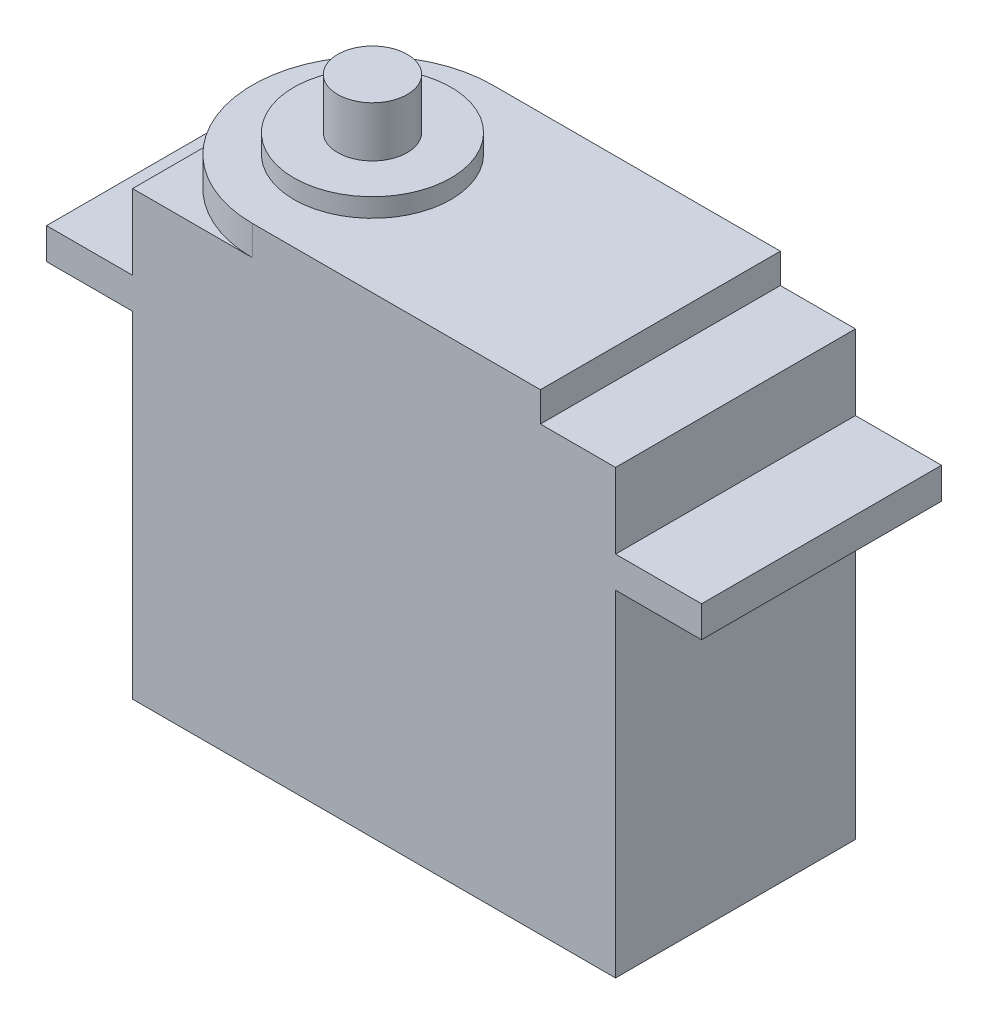
ISO-10303-21;
HEADER;
FILE_DESCRIPTION(('STEP AP214'),'2;1');
FILE_NAME('part.step','',(''),(''),'','','');
FILE_SCHEMA(('AUTOMOTIVE_DESIGN { 1 0 10303 214 1 1 1 1 }'));
ENDSEC;
DATA;
#1=APPLICATION_CONTEXT('core data for automotive mechanical design processes');
#2=APPLICATION_PROTOCOL_DEFINITION('international standard','automotive_design',2000,#1);
#3=PRODUCT_CONTEXT('',#1,'mechanical');
#4=PRODUCT('Part','Part','',(#3));
#5=PRODUCT_RELATED_PRODUCT_CATEGORY('part','',(#4));
#6=PRODUCT_DEFINITION_FORMATION('','',#4);
#7=PRODUCT_DEFINITION_CONTEXT('part definition',#1,'design');
#8=PRODUCT_DEFINITION('design','',#6,#7);
#9=PRODUCT_DEFINITION_SHAPE('','',#8);
#10=(LENGTH_UNIT() NAMED_UNIT(*) SI_UNIT(.MILLI.,.METRE.));
#11=(NAMED_UNIT(*) PLANE_ANGLE_UNIT() SI_UNIT($,.RADIAN.));
#12=(NAMED_UNIT(*) SI_UNIT($,.STERADIAN.) SOLID_ANGLE_UNIT());
#13=UNCERTAINTY_MEASURE_WITH_UNIT(LENGTH_MEASURE(1.E-05),#10,'distance_accuracy_value','');
#14=(GEOMETRIC_REPRESENTATION_CONTEXT(3) GLOBAL_UNCERTAINTY_ASSIGNED_CONTEXT((#13)) GLOBAL_UNIT_ASSIGNED_CONTEXT((#10,
#11,#12)) REPRESENTATION_CONTEXT('',''));
#15=CARTESIAN_POINT('',(0.,0.,0.));
#16=DIRECTION('',(0.,0.,1.));
#17=DIRECTION('',(1.,0.,0.));
#18=AXIS2_PLACEMENT_3D('',#15,#16,#17);
#19=CARTESIAN_POINT('',(-10.13,40.9,0.));
#20=DIRECTION('',(0.,1.,0.));
#21=DIRECTION('',(0.,0.,1.));
#22=AXIS2_PLACEMENT_3D('',#19,#20,#21);
#23=PLANE('',#22);
#24=CARTESIAN_POINT('',(-10.13,40.9,0.));
#25=DIRECTION('',(0.,1.,0.));
#26=DIRECTION('',(0.,0.,1.));
#27=AXIS2_PLACEMENT_3D('',#24,#25,#26);
#28=CIRCLE('',#27,6.55);
#29=CARTESIAN_POINT('',(-10.13,40.9,6.55));
#30=VERTEX_POINT('',#29);
#31=EDGE_CURVE('E186',#30,#30,#28,.T.);
#32=ORIENTED_EDGE('',*,*,#31,.T.);
#33=EDGE_LOOP('',(#32));
#34=FACE_BOUND('',#33,.T.);
#35=CARTESIAN_POINT('',(-10.13,40.9,0.));
#36=DIRECTION('',(0.,1.,0.));
#37=DIRECTION('',(0.,0.,1.));
#38=AXIS2_PLACEMENT_3D('',#35,#36,#37);
#39=CIRCLE('',#38,2.9);
#40=CARTESIAN_POINT('',(-10.13,40.9,2.9));
#41=VERTEX_POINT('',#40);
#42=EDGE_CURVE('E215',#41,#41,#39,.T.);
#43=ORIENTED_EDGE('',*,*,#42,.F.);
#44=EDGE_LOOP('',(#43));
#45=FACE_BOUND('',#44,.T.);
#46=ADVANCED_FACE('F34',(#34,#45),#23,.T.);
#47=CARTESIAN_POINT('',(0.,39.34,0.));
#48=DIRECTION('',(0.,1.,0.));
#49=DIRECTION('',(0.,0.,1.));
#50=AXIS2_PLACEMENT_3D('',#47,#48,#49);
#51=PLANE('',#50);
#52=CARTESIAN_POINT('',(-10.13,39.34,0.));
#53=DIRECTION('',(0.,1.,0.));
#54=DIRECTION('',(0.,0.,1.));
#55=AXIS2_PLACEMENT_3D('',#52,#53,#54);
#56=CIRCLE('',#55,10.);
#57=CARTESIAN_POINT('',(-10.13,39.34,-10.));
#58=VERTEX_POINT('',#57);
#59=CARTESIAN_POINT('',(-10.13,39.34,10.));
#60=VERTEX_POINT('',#59);
#61=EDGE_CURVE('E164',#58,#60,#56,.T.);
#62=ORIENTED_EDGE('',*,*,#61,.T.);
#63=DIRECTION('',(1.,0.,0.));
#64=VECTOR('',#63,1.);
#65=CARTESIAN_POINT('',(0.,39.34,10.));
#66=LINE('',#65,#64);
#67=CARTESIAN_POINT('',(13.87,39.34,10.));
#68=VERTEX_POINT('',#67);
#69=EDGE_CURVE('E152',#60,#68,#66,.T.);
#70=ORIENTED_EDGE('',*,*,#69,.T.);
#71=DIRECTION('',(0.,0.,1.));
#72=VECTOR('',#71,1.);
#73=CARTESIAN_POINT('',(13.87,39.34,0.));
#74=LINE('',#73,#72);
#75=CARTESIAN_POINT('',(13.87,39.34,-10.));
#76=VERTEX_POINT('',#75);
#77=EDGE_CURVE('E163',#76,#68,#74,.T.);
#78=ORIENTED_EDGE('',*,*,#77,.F.);
#79=DIRECTION('',(-1.,0.,0.));
#80=VECTOR('',#79,1.);
#81=CARTESIAN_POINT('',(0.,39.34,-10.));
#82=LINE('',#81,#80);
#83=EDGE_CURVE('E170',#76,#58,#82,.T.);
#84=ORIENTED_EDGE('',*,*,#83,.T.);
#85=EDGE_LOOP('',(#62,#70,#78,#84));
#86=FACE_BOUND('',#85,.T.);
#87=CARTESIAN_POINT('',(-10.13,39.34,0.));
#88=DIRECTION('',(0.,1.,0.));
#89=DIRECTION('',(0.,0.,1.));
#90=AXIS2_PLACEMENT_3D('',#87,#88,#89);
#91=CIRCLE('',#90,6.55);
#92=CARTESIAN_POINT('',(-10.13,39.34,6.55));
#93=VERTEX_POINT('',#92);
#94=EDGE_CURVE('E209',#93,#93,#91,.T.);
#95=ORIENTED_EDGE('',*,*,#94,.F.);
#96=EDGE_LOOP('',(#95));
#97=FACE_BOUND('',#96,.T.);
#98=ADVANCED_FACE('F167',(#86,#97),#51,.T.);
#99=CARTESIAN_POINT('',(0.,36.86,0.));
#100=DIRECTION('',(0.,-1.,0.));
#101=DIRECTION('',(0.,0.,-1.));
#102=AXIS2_PLACEMENT_3D('',#99,#100,#101);
#103=PLANE('',#102);
#104=CARTESIAN_POINT('',(-10.13,36.86,0.));
#105=DIRECTION('',(0.,1.,0.));
#106=DIRECTION('',(0.,0.,1.));
#107=AXIS2_PLACEMENT_3D('',#104,#105,#106);
#108=CIRCLE('',#107,10.);
#109=CARTESIAN_POINT('',(-10.13,36.86,-10.));
#110=VERTEX_POINT('',#109);
#111=CARTESIAN_POINT('',(-20.13,36.86,0.));
#112=VERTEX_POINT('',#111);
#113=EDGE_CURVE('E183',#110,#112,#108,.T.);
#114=ORIENTED_EDGE('',*,*,#113,.F.);
#115=DIRECTION('',(-1.,0.,0.));
#116=VECTOR('',#115,1.);
#117=CARTESIAN_POINT('',(-20.13,36.86,-10.));
#118=LINE('',#117,#116);
#119=CARTESIAN_POINT('',(-20.13,36.86,-10.));
#120=VERTEX_POINT('',#119);
#121=EDGE_CURVE('E368',#110,#120,#118,.T.);
#122=ORIENTED_EDGE('',*,*,#121,.T.);
#123=DIRECTION('',(0.,0.,1.));
#124=VECTOR('',#123,1.);
#125=CARTESIAN_POINT('',(-20.13,36.86,10.));
#126=LINE('',#125,#124);
#127=EDGE_CURVE('E371',#120,#112,#126,.T.);
#128=ORIENTED_EDGE('',*,*,#127,.T.);
#129=EDGE_LOOP('',(#114,#122,#128));
#130=FACE_BOUND('',#129,.T.);
#131=ADVANCED_FACE('F236',(#130),#103,.F.);
#132=CARTESIAN_POINT('',(-10.13,36.86,10.));
#133=VERTEX_POINT('',#132);
#134=EDGE_CURVE('E11',#112,#133,#108,.T.);
#135=ORIENTED_EDGE('',*,*,#134,.F.);
#136=CARTESIAN_POINT('',(-20.13,36.86,10.));
#137=VERTEX_POINT('',#136);
#138=EDGE_CURVE('E378',#112,#137,#126,.T.);
#139=ORIENTED_EDGE('',*,*,#138,.T.);
#140=DIRECTION('',(1.,0.,0.));
#141=VECTOR('',#140,1.);
#142=CARTESIAN_POINT('',(-20.13,36.86,10.));
#143=LINE('',#142,#141);
#144=EDGE_CURVE('E440',#137,#133,#143,.T.);
#145=ORIENTED_EDGE('',*,*,#144,.T.);
#146=EDGE_LOOP('',(#135,#139,#145));
#147=FACE_BOUND('',#146,.T.);
#148=ADVANCED_FACE('F277',(#147),#103,.F.);
#149=CARTESIAN_POINT('',(-20.13,36.86,10.));
#150=DIRECTION('',(1.,0.,0.));
#151=DIRECTION('',(0.,0.,-1.));
#152=AXIS2_PLACEMENT_3D('',#149,#150,#151);
#153=PLANE('',#152);
#154=DIRECTION('',(0.,0.,1.));
#155=VECTOR('',#154,1.);
#156=CARTESIAN_POINT('',(-20.13,28.,-10.));
#157=LINE('',#156,#155);
#158=CARTESIAN_POINT('',(-20.13,28.,-10.));
#159=VERTEX_POINT('',#158);
#160=CARTESIAN_POINT('',(-20.13,28.,10.));
#161=VERTEX_POINT('',#160);
#162=EDGE_CURVE('E59',#159,#161,#157,.T.);
#163=ORIENTED_EDGE('',*,*,#162,.F.);
#164=DIRECTION('',(0.,-1.,0.));
#165=VECTOR('',#164,1.);
#166=CARTESIAN_POINT('',(-20.13,36.86,-10.));
#167=LINE('',#166,#165);
#168=CARTESIAN_POINT('',(-20.13,0.,-10.));
#169=VERTEX_POINT('',#168);
#170=EDGE_CURVE('E299',#159,#169,#167,.T.);
#171=ORIENTED_EDGE('',*,*,#170,.T.);
#172=DIRECTION('',(0.,0.,1.));
#173=VECTOR('',#172,1.);
#174=CARTESIAN_POINT('',(-20.13,0.,10.));
#175=LINE('',#174,#173);
#176=CARTESIAN_POINT('',(-20.13,0.,10.));
#177=VERTEX_POINT('',#176);
#178=EDGE_CURVE('E305',#169,#177,#175,.T.);
#179=ORIENTED_EDGE('',*,*,#178,.T.);
#180=DIRECTION('',(0.,-1.,0.));
#181=VECTOR('',#180,1.);
#182=CARTESIAN_POINT('',(-20.13,36.86,10.));
#183=LINE('',#182,#181);
#184=EDGE_CURVE('E327',#161,#177,#183,.T.);
#185=ORIENTED_EDGE('',*,*,#184,.F.);
#186=EDGE_LOOP('',(#163,#171,#179,#185));
#187=FACE_BOUND('',#186,.T.);
#188=ADVANCED_FACE('F284',(#187),#153,.F.);
#189=DIRECTION('',(0.,0.,-1.));
#190=VECTOR('',#189,1.);
#191=CARTESIAN_POINT('',(-20.13,30.6,-10.));
#192=LINE('',#191,#190);
#193=CARTESIAN_POINT('',(-20.13,30.6,10.));
#194=VERTEX_POINT('',#193);
#195=CARTESIAN_POINT('',(-20.13,30.6,-10.));
#196=VERTEX_POINT('',#195);
#197=EDGE_CURVE('E177',#194,#196,#192,.T.);
#198=ORIENTED_EDGE('',*,*,#197,.F.);
#199=EDGE_CURVE('E339',#137,#194,#183,.T.);
#200=ORIENTED_EDGE('',*,*,#199,.F.);
#201=ORIENTED_EDGE('',*,*,#138,.F.);
#202=ORIENTED_EDGE('',*,*,#127,.F.);
#203=EDGE_CURVE('E330',#120,#196,#167,.T.);
#204=ORIENTED_EDGE('',*,*,#203,.T.);
#205=EDGE_LOOP('',(#198,#200,#201,#202,#204));
#206=FACE_BOUND('',#205,.T.);
#207=ADVANCED_FACE('F286',(#206),#153,.F.);
#208=CARTESIAN_POINT('',(20.13,36.86,10.));
#209=DIRECTION('',(-1.,0.,0.));
#210=DIRECTION('',(0.,0.,1.));
#211=AXIS2_PLACEMENT_3D('',#208,#209,#210);
#212=PLANE('',#211);
#213=DIRECTION('',(0.,0.,-1.));
#214=VECTOR('',#213,1.);
#215=CARTESIAN_POINT('',(20.13,28.,10.));
#216=LINE('',#215,#214);
#217=CARTESIAN_POINT('',(20.13,28.,10.));
#218=VERTEX_POINT('',#217);
#219=CARTESIAN_POINT('',(20.13,28.,-10.));
#220=VERTEX_POINT('',#219);
#221=EDGE_CURVE('E353',#218,#220,#216,.T.);
#222=ORIENTED_EDGE('',*,*,#221,.F.);
#223=DIRECTION('',(0.,-1.,0.));
#224=VECTOR('',#223,1.);
#225=CARTESIAN_POINT('',(20.13,36.86,10.));
#226=LINE('',#225,#224);
#227=CARTESIAN_POINT('',(20.13,0.,10.));
#228=VERTEX_POINT('',#227);
#229=EDGE_CURVE('E322',#218,#228,#226,.T.);
#230=ORIENTED_EDGE('',*,*,#229,.T.);
#231=DIRECTION('',(0.,0.,-1.));
#232=VECTOR('',#231,1.);
#233=CARTESIAN_POINT('',(20.13,0.,10.));
#234=LINE('',#233,#232);
#235=CARTESIAN_POINT('',(20.13,0.,-10.));
#236=VERTEX_POINT('',#235);
#237=EDGE_CURVE('E306',#228,#236,#234,.T.);
#238=ORIENTED_EDGE('',*,*,#237,.T.);
#239=DIRECTION('',(0.,-1.,0.));
#240=VECTOR('',#239,1.);
#241=CARTESIAN_POINT('',(20.13,36.86,-10.));
#242=LINE('',#241,#240);
#243=EDGE_CURVE('E302',#220,#236,#242,.T.);
#244=ORIENTED_EDGE('',*,*,#243,.F.);
#245=EDGE_LOOP('',(#222,#230,#238,#244));
#246=FACE_BOUND('',#245,.T.);
#247=ADVANCED_FACE('F36',(#246),#212,.F.);
#248=DIRECTION('',(0.,0.,1.));
#249=VECTOR('',#248,1.);
#250=CARTESIAN_POINT('',(20.13,30.6,10.));
#251=LINE('',#250,#249);
#252=CARTESIAN_POINT('',(20.13,30.6,-10.));
#253=VERTEX_POINT('',#252);
#254=CARTESIAN_POINT('',(20.13,30.6,10.));
#255=VERTEX_POINT('',#254);
#256=EDGE_CURVE('E358',#253,#255,#251,.T.);
#257=ORIENTED_EDGE('',*,*,#256,.F.);
#258=CARTESIAN_POINT('',(20.13,36.86,-10.));
#259=VERTEX_POINT('',#258);
#260=EDGE_CURVE('E43',#259,#253,#242,.T.);
#261=ORIENTED_EDGE('',*,*,#260,.F.);
#262=DIRECTION('',(0.,0.,-1.));
#263=VECTOR('',#262,1.);
#264=CARTESIAN_POINT('',(20.13,36.86,10.));
#265=LINE('',#264,#263);
#266=CARTESIAN_POINT('',(20.13,36.86,10.));
#267=VERTEX_POINT('',#266);
#268=EDGE_CURVE('E312',#267,#259,#265,.T.);
#269=ORIENTED_EDGE('',*,*,#268,.F.);
#270=EDGE_CURVE('E325',#267,#255,#226,.T.);
#271=ORIENTED_EDGE('',*,*,#270,.T.);
#272=EDGE_LOOP('',(#257,#261,#269,#271));
#273=FACE_BOUND('',#272,.T.);
#274=ADVANCED_FACE('F288',(#273),#212,.F.);
#275=CARTESIAN_POINT('',(-20.13,36.86,-10.));
#276=DIRECTION('',(0.,0.,1.));
#277=DIRECTION('',(1.,0.,0.));
#278=AXIS2_PLACEMENT_3D('',#275,#276,#277);
#279=PLANE('',#278);
#280=DIRECTION('',(-1.,0.,0.));
#281=VECTOR('',#280,1.);
#282=CARTESIAN_POINT('',(-20.13,0.,-10.));
#283=LINE('',#282,#281);
#284=EDGE_CURVE('E296',#236,#169,#283,.T.);
#285=ORIENTED_EDGE('',*,*,#284,.T.);
#286=ORIENTED_EDGE('',*,*,#170,.F.);
#287=DIRECTION('',(1.,0.,0.));
#288=VECTOR('',#287,1.);
#289=CARTESIAN_POINT('',(-27.3,28.,-10.));
#290=LINE('',#289,#288);
#291=CARTESIAN_POINT('',(-27.3,28.,-10.));
#292=VERTEX_POINT('',#291);
#293=EDGE_CURVE('E381',#292,#159,#290,.T.);
#294=ORIENTED_EDGE('',*,*,#293,.F.);
#295=DIRECTION('',(0.,-1.,0.));
#296=VECTOR('',#295,1.);
#297=CARTESIAN_POINT('',(-27.3,28.,-10.));
#298=LINE('',#297,#296);
#299=CARTESIAN_POINT('',(-27.3,30.6,-10.));
#300=VERTEX_POINT('',#299);
#301=EDGE_CURVE('E433',#300,#292,#298,.T.);
#302=ORIENTED_EDGE('',*,*,#301,.F.);
#303=DIRECTION('',(1.,0.,0.));
#304=VECTOR('',#303,1.);
#305=CARTESIAN_POINT('',(-27.3,30.6,-10.));
#306=LINE('',#305,#304);
#307=EDGE_CURVE('E383',#300,#196,#306,.T.);
#308=ORIENTED_EDGE('',*,*,#307,.T.);
#309=ORIENTED_EDGE('',*,*,#203,.F.);
#310=ORIENTED_EDGE('',*,*,#121,.F.);
#311=DIRECTION('',(0.,-1.,0.));
#312=VECTOR('',#311,1.);
#313=CARTESIAN_POINT('',(-10.13,39.34,-10.));
#314=LINE('',#313,#312);
#315=EDGE_CURVE('E205',#58,#110,#314,.T.);
#316=ORIENTED_EDGE('',*,*,#315,.F.);
#317=ORIENTED_EDGE('',*,*,#83,.F.);
#318=DIRECTION('',(0.,-1.,0.));
#319=VECTOR('',#318,1.);
#320=CARTESIAN_POINT('',(13.87,39.34,-10.));
#321=LINE('',#320,#319);
#322=CARTESIAN_POINT('',(13.87,36.86,-10.));
#323=VERTEX_POINT('',#322);
#324=EDGE_CURVE('E180',#76,#323,#321,.T.);
#325=ORIENTED_EDGE('',*,*,#324,.T.);
#326=EDGE_CURVE('E375',#259,#323,#118,.T.);
#327=ORIENTED_EDGE('',*,*,#326,.F.);
#328=ORIENTED_EDGE('',*,*,#260,.T.);
#329=DIRECTION('',(-1.,0.,0.));
#330=VECTOR('',#329,1.);
#331=CARTESIAN_POINT('',(27.3,30.6,-10.));
#332=LINE('',#331,#330);
#333=CARTESIAN_POINT('',(27.3,30.6,-10.));
#334=VERTEX_POINT('',#333);
#335=EDGE_CURVE('E413',#334,#253,#332,.T.);
#336=ORIENTED_EDGE('',*,*,#335,.F.);
#337=DIRECTION('',(0.,1.,0.));
#338=VECTOR('',#337,1.);
#339=CARTESIAN_POINT('',(27.3,28.,-10.));
#340=LINE('',#339,#338);
#341=CARTESIAN_POINT('',(27.3,28.,-10.));
#342=VERTEX_POINT('',#341);
#343=EDGE_CURVE('E357',#342,#334,#340,.T.);
#344=ORIENTED_EDGE('',*,*,#343,.F.);
#345=DIRECTION('',(-1.,0.,0.));
#346=VECTOR('',#345,1.);
#347=CARTESIAN_POINT('',(27.3,28.,-10.));
#348=LINE('',#347,#346);
#349=EDGE_CURVE('E348',#342,#220,#348,.T.);
#350=ORIENTED_EDGE('',*,*,#349,.T.);
#351=ORIENTED_EDGE('',*,*,#243,.T.);
#352=EDGE_LOOP('',(#285,#286,#294,#302,#308,#309,#310,#316,#317,#325,#327,#328,#336,#344,#350,#351));
#353=FACE_BOUND('',#352,.T.);
#354=ADVANCED_FACE('F283',(#353),#279,.F.);
#355=CARTESIAN_POINT('',(-20.13,36.86,10.));
#356=DIRECTION('',(0.,0.,-1.));
#357=DIRECTION('',(-1.,0.,0.));
#358=AXIS2_PLACEMENT_3D('',#355,#356,#357);
#359=PLANE('',#358);
#360=DIRECTION('',(1.,0.,0.));
#361=VECTOR('',#360,1.);
#362=CARTESIAN_POINT('',(-20.13,0.,10.));
#363=LINE('',#362,#361);
#364=EDGE_CURVE('E310',#177,#228,#363,.T.);
#365=ORIENTED_EDGE('',*,*,#364,.T.);
#366=ORIENTED_EDGE('',*,*,#229,.F.);
#367=DIRECTION('',(-1.,0.,0.));
#368=VECTOR('',#367,1.);
#369=CARTESIAN_POINT('',(27.3,28.,10.));
#370=LINE('',#369,#368);
#371=CARTESIAN_POINT('',(27.3,28.,10.));
#372=VERTEX_POINT('',#371);
#373=EDGE_CURVE('E344',#372,#218,#370,.T.);
#374=ORIENTED_EDGE('',*,*,#373,.F.);
#375=DIRECTION('',(0.,-1.,0.));
#376=VECTOR('',#375,1.);
#377=CARTESIAN_POINT('',(27.3,28.,10.));
#378=LINE('',#377,#376);
#379=CARTESIAN_POINT('',(27.3,30.6,10.));
#380=VERTEX_POINT('',#379);
#381=EDGE_CURVE('E404',#380,#372,#378,.T.);
#382=ORIENTED_EDGE('',*,*,#381,.F.);
#383=DIRECTION('',(-1.,0.,0.));
#384=VECTOR('',#383,1.);
#385=CARTESIAN_POINT('',(27.3,30.6,10.));
#386=LINE('',#385,#384);
#387=EDGE_CURVE('E347',#380,#255,#386,.T.);
#388=ORIENTED_EDGE('',*,*,#387,.T.);
#389=ORIENTED_EDGE('',*,*,#270,.F.);
#390=CARTESIAN_POINT('',(13.87,36.86,10.));
#391=VERTEX_POINT('',#390);
#392=EDGE_CURVE('E198',#391,#267,#143,.T.);
#393=ORIENTED_EDGE('',*,*,#392,.F.);
#394=DIRECTION('',(0.,-1.,0.));
#395=VECTOR('',#394,1.);
#396=CARTESIAN_POINT('',(13.87,39.34,10.));
#397=LINE('',#396,#395);
#398=EDGE_CURVE('E51',#68,#391,#397,.T.);
#399=ORIENTED_EDGE('',*,*,#398,.F.);
#400=ORIENTED_EDGE('',*,*,#69,.F.);
#401=DIRECTION('',(0.,-1.,0.));
#402=VECTOR('',#401,1.);
#403=CARTESIAN_POINT('',(-10.13,39.34,10.));
#404=LINE('',#403,#402);
#405=EDGE_CURVE('E158',#60,#133,#404,.T.);
#406=ORIENTED_EDGE('',*,*,#405,.T.);
#407=ORIENTED_EDGE('',*,*,#144,.F.);
#408=ORIENTED_EDGE('',*,*,#199,.T.);
#409=DIRECTION('',(1.,0.,0.));
#410=VECTOR('',#409,1.);
#411=CARTESIAN_POINT('',(-27.3,30.6,10.));
#412=LINE('',#411,#410);
#413=CARTESIAN_POINT('',(-27.3,30.6,10.));
#414=VERTEX_POINT('',#413);
#415=EDGE_CURVE('E420',#414,#194,#412,.T.);
#416=ORIENTED_EDGE('',*,*,#415,.F.);
#417=DIRECTION('',(0.,1.,0.));
#418=VECTOR('',#417,1.);
#419=CARTESIAN_POINT('',(-27.3,28.,10.));
#420=LINE('',#419,#418);
#421=CARTESIAN_POINT('',(-27.3,28.,10.));
#422=VERTEX_POINT('',#421);
#423=EDGE_CURVE('E392',#422,#414,#420,.T.);
#424=ORIENTED_EDGE('',*,*,#423,.F.);
#425=DIRECTION('',(1.,0.,0.));
#426=VECTOR('',#425,1.);
#427=CARTESIAN_POINT('',(-27.3,28.,10.));
#428=LINE('',#427,#426);
#429=EDGE_CURVE('E384',#422,#161,#428,.T.);
#430=ORIENTED_EDGE('',*,*,#429,.T.);
#431=ORIENTED_EDGE('',*,*,#184,.T.);
#432=EDGE_LOOP('',(#365,#366,#374,#382,#388,#389,#393,#399,#400,#406,#407,#408,#416,#424,#430,#431));
#433=FACE_BOUND('',#432,.T.);
#434=ADVANCED_FACE('F155',(#433),#359,.F.);
#435=ORIENTED_EDGE('',*,*,#326,.T.);
#436=DIRECTION('',(0.,0.,1.));
#437=VECTOR('',#436,1.);
#438=CARTESIAN_POINT('',(13.87,36.86,0.));
#439=LINE('',#438,#437);
#440=EDGE_CURVE('E173',#323,#391,#439,.T.);
#441=ORIENTED_EDGE('',*,*,#440,.T.);
#442=ORIENTED_EDGE('',*,*,#392,.T.);
#443=ORIENTED_EDGE('',*,*,#268,.T.);
#444=EDGE_LOOP('',(#435,#441,#442,#443));
#445=FACE_BOUND('',#444,.T.);
#446=ADVANCED_FACE('F273',(#445),#103,.F.);
#447=CARTESIAN_POINT('',(0.,0.,0.));
#448=DIRECTION('',(0.,-1.,0.));
#449=DIRECTION('',(0.,0.,-1.));
#450=AXIS2_PLACEMENT_3D('',#447,#448,#449);
#451=PLANE('',#450);
#452=ORIENTED_EDGE('',*,*,#237,.F.);
#453=ORIENTED_EDGE('',*,*,#364,.F.);
#454=ORIENTED_EDGE('',*,*,#178,.F.);
#455=ORIENTED_EDGE('',*,*,#284,.F.);
#456=EDGE_LOOP('',(#452,#453,#454,#455));
#457=FACE_BOUND('',#456,.T.);
#458=ADVANCED_FACE('F271',(#457),#451,.T.);
#459=CARTESIAN_POINT('',(27.3,30.6,10.));
#460=DIRECTION('',(0.,-1.,0.));
#461=DIRECTION('',(0.,0.,-1.));
#462=AXIS2_PLACEMENT_3D('',#459,#460,#461);
#463=PLANE('',#462);
#464=ORIENTED_EDGE('',*,*,#256,.T.);
#465=ORIENTED_EDGE('',*,*,#387,.F.);
#466=DIRECTION('',(0.,0.,1.));
#467=VECTOR('',#466,1.);
#468=CARTESIAN_POINT('',(27.3,30.6,10.));
#469=LINE('',#468,#467);
#470=EDGE_CURVE('E402',#334,#380,#469,.T.);
#471=ORIENTED_EDGE('',*,*,#470,.F.);
#472=ORIENTED_EDGE('',*,*,#335,.T.);
#473=EDGE_LOOP('',(#464,#465,#471,#472));
#474=FACE_BOUND('',#473,.T.);
#475=ADVANCED_FACE('F267',(#474),#463,.F.);
#476=CARTESIAN_POINT('',(27.3,28.,10.));
#477=DIRECTION('',(0.,1.,0.));
#478=DIRECTION('',(0.,0.,1.));
#479=AXIS2_PLACEMENT_3D('',#476,#477,#478);
#480=PLANE('',#479);
#481=ORIENTED_EDGE('',*,*,#221,.T.);
#482=ORIENTED_EDGE('',*,*,#349,.F.);
#483=DIRECTION('',(0.,0.,-1.));
#484=VECTOR('',#483,1.);
#485=CARTESIAN_POINT('',(27.3,28.,10.));
#486=LINE('',#485,#484);
#487=EDGE_CURVE('E352',#372,#342,#486,.T.);
#488=ORIENTED_EDGE('',*,*,#487,.F.);
#489=ORIENTED_EDGE('',*,*,#373,.T.);
#490=EDGE_LOOP('',(#481,#482,#488,#489));
#491=FACE_BOUND('',#490,.T.);
#492=ADVANCED_FACE('F263',(#491),#480,.F.);
#493=CARTESIAN_POINT('',(27.3,0.,0.));
#494=DIRECTION('',(-1.,0.,0.));
#495=DIRECTION('',(0.,0.,1.));
#496=AXIS2_PLACEMENT_3D('',#493,#494,#495);
#497=PLANE('',#496);
#498=ORIENTED_EDGE('',*,*,#343,.T.);
#499=ORIENTED_EDGE('',*,*,#470,.T.);
#500=ORIENTED_EDGE('',*,*,#381,.T.);
#501=ORIENTED_EDGE('',*,*,#487,.T.);
#502=EDGE_LOOP('',(#498,#499,#500,#501));
#503=FACE_BOUND('',#502,.T.);
#504=ADVANCED_FACE('F259',(#503),#497,.F.);
#505=CARTESIAN_POINT('',(-27.3,30.6,-10.));
#506=DIRECTION('',(0.,-1.,0.));
#507=DIRECTION('',(0.,0.,-1.));
#508=AXIS2_PLACEMENT_3D('',#505,#506,#507);
#509=PLANE('',#508);
#510=ORIENTED_EDGE('',*,*,#197,.T.);
#511=ORIENTED_EDGE('',*,*,#307,.F.);
#512=DIRECTION('',(0.,0.,-1.));
#513=VECTOR('',#512,1.);
#514=CARTESIAN_POINT('',(-27.3,30.6,-10.));
#515=LINE('',#514,#513);
#516=EDGE_CURVE('E434',#414,#300,#515,.T.);
#517=ORIENTED_EDGE('',*,*,#516,.F.);
#518=ORIENTED_EDGE('',*,*,#415,.T.);
#519=EDGE_LOOP('',(#510,#511,#517,#518));
#520=FACE_BOUND('',#519,.T.);
#521=ADVANCED_FACE('F255',(#520),#509,.F.);
#522=CARTESIAN_POINT('',(-27.3,28.,-10.));
#523=DIRECTION('',(0.,1.,0.));
#524=DIRECTION('',(0.,0.,1.));
#525=AXIS2_PLACEMENT_3D('',#522,#523,#524);
#526=PLANE('',#525);
#527=ORIENTED_EDGE('',*,*,#162,.T.);
#528=ORIENTED_EDGE('',*,*,#429,.F.);
#529=DIRECTION('',(0.,0.,1.));
#530=VECTOR('',#529,1.);
#531=CARTESIAN_POINT('',(-27.3,28.,-10.));
#532=LINE('',#531,#530);
#533=EDGE_CURVE('E389',#292,#422,#532,.T.);
#534=ORIENTED_EDGE('',*,*,#533,.F.);
#535=ORIENTED_EDGE('',*,*,#293,.T.);
#536=EDGE_LOOP('',(#527,#528,#534,#535));
#537=FACE_BOUND('',#536,.T.);
#538=ADVANCED_FACE('F251',(#537),#526,.F.);
#539=CARTESIAN_POINT('',(-27.3,0.,0.));
#540=DIRECTION('',(1.,0.,0.));
#541=DIRECTION('',(0.,0.,-1.));
#542=AXIS2_PLACEMENT_3D('',#539,#540,#541);
#543=PLANE('',#542);
#544=ORIENTED_EDGE('',*,*,#423,.T.);
#545=ORIENTED_EDGE('',*,*,#516,.T.);
#546=ORIENTED_EDGE('',*,*,#301,.T.);
#547=ORIENTED_EDGE('',*,*,#533,.T.);
#548=EDGE_LOOP('',(#544,#545,#546,#547));
#549=FACE_BOUND('',#548,.T.);
#550=ADVANCED_FACE('F248',(#549),#543,.F.);
#551=CARTESIAN_POINT('',(-10.13,39.34,0.));
#552=DIRECTION('',(0.,-1.,0.));
#553=DIRECTION('',(0.,0.,-1.));
#554=AXIS2_PLACEMENT_3D('',#551,#552,#553);
#555=CYLINDRICAL_SURFACE('',#554,10.);
#556=ORIENTED_EDGE('',*,*,#113,.T.);
#557=ORIENTED_EDGE('',*,*,#134,.T.);
#558=ORIENTED_EDGE('',*,*,#405,.F.);
#559=ORIENTED_EDGE('',*,*,#61,.F.);
#560=ORIENTED_EDGE('',*,*,#315,.T.);
#561=EDGE_LOOP('',(#556,#557,#558,#559,#560));
#562=FACE_BOUND('',#561,.T.);
#563=ADVANCED_FACE('F175',(#562),#555,.T.);
#564=CARTESIAN_POINT('',(13.87,39.34,0.));
#565=DIRECTION('',(1.,0.,0.));
#566=DIRECTION('',(0.,0.,-1.));
#567=AXIS2_PLACEMENT_3D('',#564,#565,#566);
#568=PLANE('',#567);
#569=ORIENTED_EDGE('',*,*,#440,.F.);
#570=ORIENTED_EDGE('',*,*,#324,.F.);
#571=ORIENTED_EDGE('',*,*,#77,.T.);
#572=ORIENTED_EDGE('',*,*,#398,.T.);
#573=EDGE_LOOP('',(#569,#570,#571,#572));
#574=FACE_BOUND('',#573,.T.);
#575=ADVANCED_FACE('F241',(#574),#568,.T.);
#576=CARTESIAN_POINT('',(-10.13,40.9,0.));
#577=DIRECTION('',(0.,-1.,0.));
#578=DIRECTION('',(0.,0.,-1.));
#579=AXIS2_PLACEMENT_3D('',#576,#577,#578);
#580=CYLINDRICAL_SURFACE('',#579,6.55);
#581=ORIENTED_EDGE('',*,*,#31,.F.);
#582=EDGE_LOOP('',(#581));
#583=FACE_BOUND('',#582,.T.);
#584=ORIENTED_EDGE('',*,*,#94,.T.);
#585=EDGE_LOOP('',(#584));
#586=FACE_BOUND('',#585,.T.);
#587=ADVANCED_FACE('F226',(#583,#586),#580,.T.);
#588=CARTESIAN_POINT('',(-10.13,45.1,0.));
#589=DIRECTION('',(0.,-1.,0.));
#590=DIRECTION('',(0.,0.,-1.));
#591=AXIS2_PLACEMENT_3D('',#588,#589,#590);
#592=CYLINDRICAL_SURFACE('',#591,2.9);
#593=CARTESIAN_POINT('',(-10.13,45.1,0.));
#594=DIRECTION('',(0.,1.,0.));
#595=DIRECTION('',(0.,0.,1.));
#596=AXIS2_PLACEMENT_3D('',#593,#594,#595);
#597=CIRCLE('',#596,2.9);
#598=CARTESIAN_POINT('',(-10.13,45.1,2.9));
#599=VERTEX_POINT('',#598);
#600=EDGE_CURVE('E212',#599,#599,#597,.T.);
#601=ORIENTED_EDGE('',*,*,#600,.F.);
#602=EDGE_LOOP('',(#601));
#603=FACE_BOUND('',#602,.T.);
#604=ORIENTED_EDGE('',*,*,#42,.T.);
#605=EDGE_LOOP('',(#604));
#606=FACE_BOUND('',#605,.T.);
#607=ADVANCED_FACE('F223',(#603,#606),#592,.T.);
#608=CARTESIAN_POINT('',(-10.13,45.1,0.));
#609=DIRECTION('',(0.,1.,0.));
#610=DIRECTION('',(0.,0.,1.));
#611=AXIS2_PLACEMENT_3D('',#608,#609,#610);
#612=PLANE('',#611);
#613=ORIENTED_EDGE('',*,*,#600,.T.);
#614=EDGE_LOOP('',(#613));
#615=FACE_BOUND('',#614,.T.);
#616=ADVANCED_FACE('F221',(#615),#612,.T.);
#617=CLOSED_SHELL('',(#46,#98,#131,#148,#188,#207,#247,#274,#354,#434,#446,#458,#475,#492,#504,
#521,#538,#550,#563,#575,#587,#607,#616));
#618=MANIFOLD_SOLID_BREP('B2',#617);
#619=ADVANCED_BREP_SHAPE_REPRESENTATION('',(#18,#618),#14);
#620=SHAPE_DEFINITION_REPRESENTATION(#9,#619);
ENDSEC;
END-ISO-10303-21;
